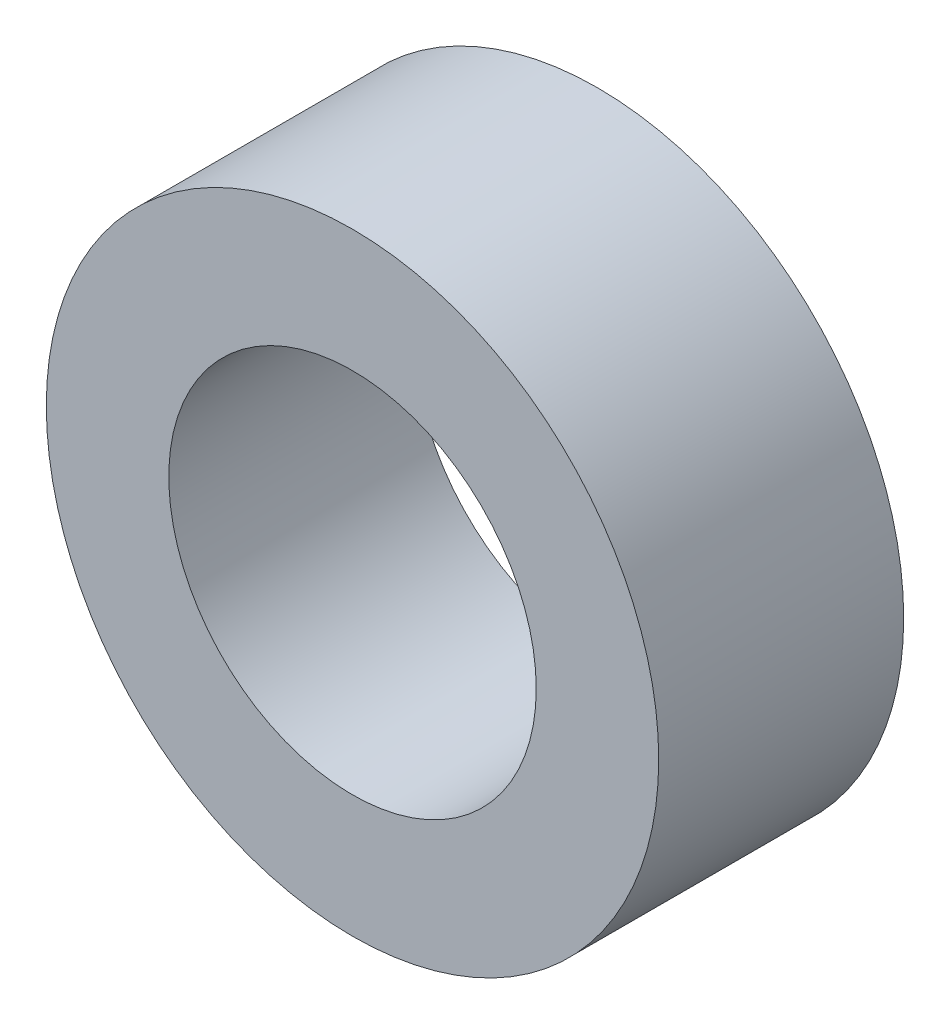
ISO-10303-21;
HEADER;
FILE_DESCRIPTION(('STEP AP214'),'2;1');
FILE_NAME('part.step','',(''),(''),'','','');
FILE_SCHEMA(('AUTOMOTIVE_DESIGN { 1 0 10303 214 1 1 1 1 }'));
ENDSEC;
DATA;
#1=APPLICATION_CONTEXT('core data for automotive mechanical design processes');
#2=APPLICATION_PROTOCOL_DEFINITION('international standard','automotive_design',2000,#1);
#3=PRODUCT_CONTEXT('',#1,'mechanical');
#4=PRODUCT('Part','Part','',(#3));
#5=PRODUCT_RELATED_PRODUCT_CATEGORY('part','',(#4));
#6=PRODUCT_DEFINITION_FORMATION('','',#4);
#7=PRODUCT_DEFINITION_CONTEXT('part definition',#1,'design');
#8=PRODUCT_DEFINITION('design','',#6,#7);
#9=PRODUCT_DEFINITION_SHAPE('','',#8);
#10=(LENGTH_UNIT() NAMED_UNIT(*) SI_UNIT(.MILLI.,.METRE.));
#11=(NAMED_UNIT(*) PLANE_ANGLE_UNIT() SI_UNIT($,.RADIAN.));
#12=(NAMED_UNIT(*) SI_UNIT($,.STERADIAN.) SOLID_ANGLE_UNIT());
#13=UNCERTAINTY_MEASURE_WITH_UNIT(LENGTH_MEASURE(1.E-05),#10,'distance_accuracy_value','');
#14=(GEOMETRIC_REPRESENTATION_CONTEXT(3) GLOBAL_UNCERTAINTY_ASSIGNED_CONTEXT((#13)) GLOBAL_UNIT_ASSIGNED_CONTEXT((#10,
#11,#12)) REPRESENTATION_CONTEXT('',''));
#15=CARTESIAN_POINT('',(0.,0.,0.));
#16=DIRECTION('',(0.,0.,1.));
#17=DIRECTION('',(1.,0.,0.));
#18=AXIS2_PLACEMENT_3D('',#15,#16,#17);
#19=CARTESIAN_POINT('',(0.,0.,6.35));
#20=DIRECTION('',(0.,0.,1.));
#21=DIRECTION('',(1.,0.,0.));
#22=AXIS2_PLACEMENT_3D('',#19,#20,#21);
#23=PLANE('',#22);
#24=CARTESIAN_POINT('',(0.,0.,6.35));
#25=DIRECTION('',(0.,0.,1.));
#26=DIRECTION('',(1.,0.,0.));
#27=AXIS2_PLACEMENT_3D('',#24,#25,#26);
#28=CIRCLE('',#27,7.9375);
#29=CARTESIAN_POINT('',(7.9375,0.,6.35));
#30=VERTEX_POINT('',#29);
#31=EDGE_CURVE('E10',#30,#30,#28,.T.);
#32=ORIENTED_EDGE('',*,*,#31,.T.);
#33=EDGE_LOOP('',(#32));
#34=FACE_BOUND('',#33,.T.);
#35=CARTESIAN_POINT('',(0.,0.,6.35));
#36=DIRECTION('',(0.,0.,1.));
#37=DIRECTION('',(1.,0.,0.));
#38=AXIS2_PLACEMENT_3D('',#35,#36,#37);
#39=CIRCLE('',#38,4.7625);
#40=CARTESIAN_POINT('',(4.7625,0.,6.35));
#41=VERTEX_POINT('',#40);
#42=EDGE_CURVE('E42',#41,#41,#39,.T.);
#43=ORIENTED_EDGE('',*,*,#42,.F.);
#44=EDGE_LOOP('',(#43));
#45=FACE_BOUND('',#44,.T.);
#46=ADVANCED_FACE('F31',(#34,#45),#23,.T.);
#47=CARTESIAN_POINT('',(0.,0.,0.));
#48=DIRECTION('',(0.,0.,1.));
#49=DIRECTION('',(1.,0.,0.));
#50=AXIS2_PLACEMENT_3D('',#47,#48,#49);
#51=PLANE('',#50);
#52=CARTESIAN_POINT('',(0.,0.,0.));
#53=DIRECTION('',(0.,0.,1.));
#54=DIRECTION('',(1.,0.,0.));
#55=AXIS2_PLACEMENT_3D('',#52,#53,#54);
#56=CIRCLE('',#55,7.9375);
#57=CARTESIAN_POINT('',(7.9375,0.,0.));
#58=VERTEX_POINT('',#57);
#59=EDGE_CURVE('E35',#58,#58,#56,.T.);
#60=ORIENTED_EDGE('',*,*,#59,.F.);
#61=EDGE_LOOP('',(#60));
#62=FACE_BOUND('',#61,.T.);
#63=CARTESIAN_POINT('',(0.,0.,0.));
#64=DIRECTION('',(0.,0.,1.));
#65=DIRECTION('',(1.,0.,0.));
#66=AXIS2_PLACEMENT_3D('',#63,#64,#65);
#67=CIRCLE('',#66,4.7625);
#68=CARTESIAN_POINT('',(4.7625,0.,0.));
#69=VERTEX_POINT('',#68);
#70=EDGE_CURVE('E44',#69,#69,#67,.T.);
#71=ORIENTED_EDGE('',*,*,#70,.T.);
#72=EDGE_LOOP('',(#71));
#73=FACE_BOUND('',#72,.T.);
#74=ADVANCED_FACE('F54',(#62,#73),#51,.F.);
#75=CARTESIAN_POINT('',(0.,0.,6.35));
#76=DIRECTION('',(0.,0.,-1.));
#77=DIRECTION('',(-1.,0.,0.));
#78=AXIS2_PLACEMENT_3D('',#75,#76,#77);
#79=CYLINDRICAL_SURFACE('',#78,7.9375);
#80=ORIENTED_EDGE('',*,*,#31,.F.);
#81=EDGE_LOOP('',(#80));
#82=FACE_BOUND('',#81,.T.);
#83=ORIENTED_EDGE('',*,*,#59,.T.);
#84=EDGE_LOOP('',(#83));
#85=FACE_BOUND('',#84,.T.);
#86=ADVANCED_FACE('F33',(#82,#85),#79,.T.);
#87=CARTESIAN_POINT('',(0.,0.,6.35));
#88=DIRECTION('',(0.,0.,-1.));
#89=DIRECTION('',(-1.,0.,0.));
#90=AXIS2_PLACEMENT_3D('',#87,#88,#89);
#91=CYLINDRICAL_SURFACE('',#90,4.7625);
#92=ORIENTED_EDGE('',*,*,#42,.T.);
#93=EDGE_LOOP('',(#92));
#94=FACE_BOUND('',#93,.T.);
#95=ORIENTED_EDGE('',*,*,#70,.F.);
#96=EDGE_LOOP('',(#95));
#97=FACE_BOUND('',#96,.T.);
#98=ADVANCED_FACE('F50',(#94,#97),#91,.F.);
#99=CLOSED_SHELL('',(#46,#74,#86,#98));
#100=MANIFOLD_SOLID_BREP('B2',#99);
#101=ADVANCED_BREP_SHAPE_REPRESENTATION('',(#18,#100),#14);
#102=SHAPE_DEFINITION_REPRESENTATION(#9,#101);
ENDSEC;
END-ISO-10303-21;
